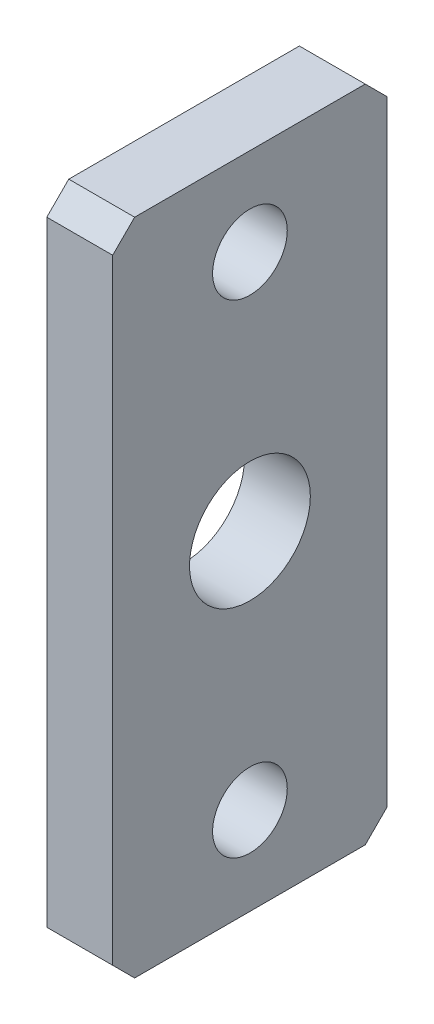
ISO-10303-21;
HEADER;
FILE_DESCRIPTION(('STEP AP214'),'2;1');
FILE_NAME('part.step','',(''),(''),'','','');
FILE_SCHEMA(('AUTOMOTIVE_DESIGN { 1 0 10303 214 1 1 1 1 }'));
ENDSEC;
DATA;
#1=APPLICATION_CONTEXT('core data for automotive mechanical design processes');
#2=APPLICATION_PROTOCOL_DEFINITION('international standard','automotive_design',2000,#1);
#3=PRODUCT_CONTEXT('',#1,'mechanical');
#4=PRODUCT('Part','Part','',(#3));
#5=PRODUCT_RELATED_PRODUCT_CATEGORY('part','',(#4));
#6=PRODUCT_DEFINITION_FORMATION('','',#4);
#7=PRODUCT_DEFINITION_CONTEXT('part definition',#1,'design');
#8=PRODUCT_DEFINITION('design','',#6,#7);
#9=PRODUCT_DEFINITION_SHAPE('','',#8);
#10=(LENGTH_UNIT() NAMED_UNIT(*) SI_UNIT(.MILLI.,.METRE.));
#11=(NAMED_UNIT(*) PLANE_ANGLE_UNIT() SI_UNIT($,.RADIAN.));
#12=(NAMED_UNIT(*) SI_UNIT($,.STERADIAN.) SOLID_ANGLE_UNIT());
#13=UNCERTAINTY_MEASURE_WITH_UNIT(LENGTH_MEASURE(1.E-05),#10,'distance_accuracy_value','');
#14=(GEOMETRIC_REPRESENTATION_CONTEXT(3) GLOBAL_UNCERTAINTY_ASSIGNED_CONTEXT((#13)) GLOBAL_UNIT_ASSIGNED_CONTEXT((#10,
#11,#12)) REPRESENTATION_CONTEXT('',''));
#15=CARTESIAN_POINT('',(0.,0.,0.));
#16=DIRECTION('',(0.,0.,1.));
#17=DIRECTION('',(1.,0.,0.));
#18=AXIS2_PLACEMENT_3D('',#15,#16,#17);
#19=CARTESIAN_POINT('',(-6.00000000000001,30.,0.));
#20=DIRECTION('',(0.,0.,1.));
#21=DIRECTION('',(1.,0.,0.));
#22=AXIS2_PLACEMENT_3D('',#19,#20,#21);
#23=PLANE('',#22);
#24=DIRECTION('',(0.,-1.,0.));
#25=VECTOR('',#24,1.);
#26=CARTESIAN_POINT('',(-6.00000000000001,30.,0.));
#27=LINE('',#26,#25);
#28=CARTESIAN_POINT('',(-6.00000000000001,28.,0.));
#29=VERTEX_POINT('',#28);
#30=CARTESIAN_POINT('',(-6.00000000000001,-28.,0.));
#31=VERTEX_POINT('',#30);
#32=EDGE_CURVE('E157',#29,#31,#27,.T.);
#33=ORIENTED_EDGE('',*,*,#32,.T.);
#34=DIRECTION('',(1.,0.,0.));
#35=VECTOR('',#34,1.);
#36=CARTESIAN_POINT('',(-6.00000000000001,-28.,0.));
#37=LINE('',#36,#35);
#38=CARTESIAN_POINT('',(0.,-28.,0.));
#39=VERTEX_POINT('',#38);
#40=EDGE_CURVE('E11',#31,#39,#37,.T.);
#41=ORIENTED_EDGE('',*,*,#40,.T.);
#42=DIRECTION('',(0.,-1.,0.));
#43=VECTOR('',#42,1.);
#44=CARTESIAN_POINT('',(0.,30.,0.));
#45=LINE('',#44,#43);
#46=CARTESIAN_POINT('',(0.,28.,0.));
#47=VERTEX_POINT('',#46);
#48=EDGE_CURVE('E160',#47,#39,#45,.T.);
#49=ORIENTED_EDGE('',*,*,#48,.F.);
#50=DIRECTION('',(-1.,0.,0.));
#51=VECTOR('',#50,1.);
#52=CARTESIAN_POINT('',(-6.00000000000001,28.,0.));
#53=LINE('',#52,#51);
#54=EDGE_CURVE('E44',#47,#29,#53,.T.);
#55=ORIENTED_EDGE('',*,*,#54,.T.);
#56=EDGE_LOOP('',(#33,#41,#49,#55));
#57=FACE_BOUND('',#56,.T.);
#58=ADVANCED_FACE('F36',(#57),#23,.T.);
#59=CARTESIAN_POINT('',(-6.00000000000001,30.,0.));
#60=DIRECTION('',(0.,1.,0.));
#61=DIRECTION('',(0.,0.,1.));
#62=AXIS2_PLACEMENT_3D('',#59,#60,#61);
#63=PLANE('',#62);
#64=DIRECTION('',(0.,0.,1.));
#65=VECTOR('',#64,1.);
#66=CARTESIAN_POINT('',(0.,30.,0.));
#67=LINE('',#66,#65);
#68=CARTESIAN_POINT('',(0.,30.,-22.9999999999999));
#69=VERTEX_POINT('',#68);
#70=CARTESIAN_POINT('',(0.,30.,-2.));
#71=VERTEX_POINT('',#70);
#72=EDGE_CURVE('E122',#69,#71,#67,.T.);
#73=ORIENTED_EDGE('',*,*,#72,.F.);
#74=DIRECTION('',(-1.,0.,0.));
#75=VECTOR('',#74,1.);
#76=CARTESIAN_POINT('',(-6.00000000000001,30.,-22.9999999999999));
#77=LINE('',#76,#75);
#78=CARTESIAN_POINT('',(-6.00000000000001,30.,-22.9999999999999));
#79=VERTEX_POINT('',#78);
#80=EDGE_CURVE('E140',#69,#79,#77,.T.);
#81=ORIENTED_EDGE('',*,*,#80,.T.);
#82=DIRECTION('',(0.,0.,1.));
#83=VECTOR('',#82,1.);
#84=CARTESIAN_POINT('',(-6.00000000000001,30.,0.));
#85=LINE('',#84,#83);
#86=CARTESIAN_POINT('',(-6.00000000000001,30.,-2.));
#87=VERTEX_POINT('',#86);
#88=EDGE_CURVE('E125',#79,#87,#85,.T.);
#89=ORIENTED_EDGE('',*,*,#88,.T.);
#90=DIRECTION('',(1.,0.,0.));
#91=VECTOR('',#90,1.);
#92=CARTESIAN_POINT('',(-6.00000000000001,30.,-2.));
#93=LINE('',#92,#91);
#94=EDGE_CURVE('E137',#87,#71,#93,.T.);
#95=ORIENTED_EDGE('',*,*,#94,.T.);
#96=EDGE_LOOP('',(#73,#81,#89,#95));
#97=FACE_BOUND('',#96,.T.);
#98=ADVANCED_FACE('F172',(#97),#63,.T.);
#99=CARTESIAN_POINT('',(-6.00000000000001,30.,-24.9999999999999));
#100=DIRECTION('',(0.,0.,-1.));
#101=DIRECTION('',(-1.,0.,0.));
#102=AXIS2_PLACEMENT_3D('',#99,#100,#101);
#103=PLANE('',#102);
#104=DIRECTION('',(0.,1.,0.));
#105=VECTOR('',#104,1.);
#106=CARTESIAN_POINT('',(-6.00000000000001,30.,-24.9999999999999));
#107=LINE('',#106,#105);
#108=CARTESIAN_POINT('',(-6.00000000000001,-28.,-24.9999999999999));
#109=VERTEX_POINT('',#108);
#110=CARTESIAN_POINT('',(-6.00000000000001,28.,-24.9999999999999));
#111=VERTEX_POINT('',#110);
#112=EDGE_CURVE('E130',#109,#111,#107,.T.);
#113=ORIENTED_EDGE('',*,*,#112,.T.);
#114=DIRECTION('',(1.,0.,0.));
#115=VECTOR('',#114,1.);
#116=CARTESIAN_POINT('',(-6.00000000000001,28.,-24.9999999999999));
#117=LINE('',#116,#115);
#118=CARTESIAN_POINT('',(0.,28.,-24.9999999999999));
#119=VERTEX_POINT('',#118);
#120=EDGE_CURVE('E121',#111,#119,#117,.T.);
#121=ORIENTED_EDGE('',*,*,#120,.T.);
#122=DIRECTION('',(0.,1.,0.));
#123=VECTOR('',#122,1.);
#124=CARTESIAN_POINT('',(0.,30.,-24.9999999999999));
#125=LINE('',#124,#123);
#126=CARTESIAN_POINT('',(0.,-28.,-24.9999999999999));
#127=VERTEX_POINT('',#126);
#128=EDGE_CURVE('E106',#127,#119,#125,.T.);
#129=ORIENTED_EDGE('',*,*,#128,.F.);
#130=DIRECTION('',(-1.,0.,0.));
#131=VECTOR('',#130,1.);
#132=CARTESIAN_POINT('',(-6.00000000000001,-28.,-24.9999999999999));
#133=LINE('',#132,#131);
#134=EDGE_CURVE('E119',#127,#109,#133,.T.);
#135=ORIENTED_EDGE('',*,*,#134,.T.);
#136=EDGE_LOOP('',(#113,#121,#129,#135));
#137=FACE_BOUND('',#136,.T.);
#138=ADVANCED_FACE('F118',(#137),#103,.T.);
#139=CARTESIAN_POINT('',(-6.00000000000001,-30.,0.));
#140=DIRECTION('',(0.,-1.,0.));
#141=DIRECTION('',(0.,0.,-1.));
#142=AXIS2_PLACEMENT_3D('',#139,#140,#141);
#143=PLANE('',#142);
#144=DIRECTION('',(0.,0.,-1.));
#145=VECTOR('',#144,1.);
#146=CARTESIAN_POINT('',(-6.00000000000001,-30.,0.));
#147=LINE('',#146,#145);
#148=CARTESIAN_POINT('',(-6.00000000000001,-30.,-2.));
#149=VERTEX_POINT('',#148);
#150=CARTESIAN_POINT('',(-6.00000000000001,-30.,-22.9999999999999));
#151=VERTEX_POINT('',#150);
#152=EDGE_CURVE('E166',#149,#151,#147,.T.);
#153=ORIENTED_EDGE('',*,*,#152,.T.);
#154=DIRECTION('',(1.,0.,0.));
#155=VECTOR('',#154,1.);
#156=CARTESIAN_POINT('',(-6.00000000000001,-30.,-22.9999999999999));
#157=LINE('',#156,#155);
#158=CARTESIAN_POINT('',(0.,-30.,-22.9999999999999));
#159=VERTEX_POINT('',#158);
#160=EDGE_CURVE('E151',#151,#159,#157,.T.);
#161=ORIENTED_EDGE('',*,*,#160,.T.);
#162=DIRECTION('',(0.,0.,-1.));
#163=VECTOR('',#162,1.);
#164=CARTESIAN_POINT('',(0.,-30.,0.));
#165=LINE('',#164,#163);
#166=CARTESIAN_POINT('',(0.,-30.,-2.));
#167=VERTEX_POINT('',#166);
#168=EDGE_CURVE('E107',#167,#159,#165,.T.);
#169=ORIENTED_EDGE('',*,*,#168,.F.);
#170=DIRECTION('',(-1.,0.,0.));
#171=VECTOR('',#170,1.);
#172=CARTESIAN_POINT('',(-6.00000000000001,-30.,-2.));
#173=LINE('',#172,#171);
#174=EDGE_CURVE('E58',#167,#149,#173,.T.);
#175=ORIENTED_EDGE('',*,*,#174,.T.);
#176=EDGE_LOOP('',(#153,#161,#169,#175));
#177=FACE_BOUND('',#176,.T.);
#178=ADVANCED_FACE('F235',(#177),#143,.T.);
#179=CARTESIAN_POINT('',(-6.00000000000001,-30.,0.));
#180=DIRECTION('',(1.,0.,0.));
#181=DIRECTION('',(0.,0.,-1.));
#182=AXIS2_PLACEMENT_3D('',#179,#180,#181);
#183=PLANE('',#182);
#184=CARTESIAN_POINT('',(-6.00000000000001,22.,-12.5));
#185=DIRECTION('',(1.,0.,0.));
#186=DIRECTION('',(0.,0.,-1.));
#187=AXIS2_PLACEMENT_3D('',#184,#185,#186);
#188=CIRCLE('',#187,3.4);
#189=CARTESIAN_POINT('',(-6.00000000000001,22.,-15.9));
#190=VERTEX_POINT('',#189);
#191=EDGE_CURVE('E200',#190,#190,#188,.T.);
#192=ORIENTED_EDGE('',*,*,#191,.T.);
#193=EDGE_LOOP('',(#192));
#194=FACE_BOUND('',#193,.T.);
#195=CARTESIAN_POINT('',(-6.00000000000001,-22.,-12.5));
#196=DIRECTION('',(1.,0.,0.));
#197=DIRECTION('',(0.,0.,-1.));
#198=AXIS2_PLACEMENT_3D('',#195,#196,#197);
#199=CIRCLE('',#198,3.4);
#200=CARTESIAN_POINT('',(-6.00000000000001,-22.,-15.9));
#201=VERTEX_POINT('',#200);
#202=EDGE_CURVE('E192',#201,#201,#199,.T.);
#203=ORIENTED_EDGE('',*,*,#202,.T.);
#204=EDGE_LOOP('',(#203));
#205=FACE_BOUND('',#204,.T.);
#206=CARTESIAN_POINT('',(-6.00000000000001,0.,-12.5));
#207=DIRECTION('',(1.,0.,0.));
#208=DIRECTION('',(0.,0.,-1.));
#209=AXIS2_PLACEMENT_3D('',#206,#207,#208);
#210=CIRCLE('',#209,5.5);
#211=CARTESIAN_POINT('',(-6.00000000000001,0.,-18.));
#212=VERTEX_POINT('',#211);
#213=EDGE_CURVE('E182',#212,#212,#210,.T.);
#214=ORIENTED_EDGE('',*,*,#213,.T.);
#215=EDGE_LOOP('',(#214));
#216=FACE_BOUND('',#215,.T.);
#217=ORIENTED_EDGE('',*,*,#88,.F.);
#218=DIRECTION('',(0.,0.707106781186546,0.707106781186549));
#219=VECTOR('',#218,1.);
#220=CARTESIAN_POINT('',(-6.00000000000001,28.,-24.9999999999999));
#221=LINE('',#220,#219);
#222=EDGE_CURVE('E147',#79,#111,#221,.F.);
#223=ORIENTED_EDGE('',*,*,#222,.T.);
#224=ORIENTED_EDGE('',*,*,#112,.F.);
#225=DIRECTION('',(0.,0.707106781186549,-0.707106781186546));
#226=VECTOR('',#225,1.);
#227=CARTESIAN_POINT('',(-6.00000000000001,-30.,-22.9999999999999));
#228=LINE('',#227,#226);
#229=EDGE_CURVE('E51',#109,#151,#228,.F.);
#230=ORIENTED_EDGE('',*,*,#229,.T.);
#231=ORIENTED_EDGE('',*,*,#152,.F.);
#232=DIRECTION('',(0.,-0.707106781186546,-0.707106781186549));
#233=VECTOR('',#232,1.);
#234=CARTESIAN_POINT('',(-6.00000000000001,-28.,0.));
#235=LINE('',#234,#233);
#236=EDGE_CURVE('E144',#149,#31,#235,.F.);
#237=ORIENTED_EDGE('',*,*,#236,.T.);
#238=ORIENTED_EDGE('',*,*,#32,.F.);
#239=DIRECTION('',(0.,-0.707106781186549,0.707106781186546));
#240=VECTOR('',#239,1.);
#241=CARTESIAN_POINT('',(-6.00000000000001,30.,-2.));
#242=LINE('',#241,#240);
#243=EDGE_CURVE('E142',#29,#87,#242,.F.);
#244=ORIENTED_EDGE('',*,*,#243,.T.);
#245=EDGE_LOOP('',(#217,#223,#224,#230,#231,#237,#238,#244));
#246=FACE_BOUND('',#245,.T.);
#247=ADVANCED_FACE('F164',(#194,#205,#216,#246),#183,.F.);
#248=CARTESIAN_POINT('',(0.,-30.,0.));
#249=DIRECTION('',(1.,0.,0.));
#250=DIRECTION('',(0.,0.,-1.));
#251=AXIS2_PLACEMENT_3D('',#248,#249,#250);
#252=PLANE('',#251);
#253=CARTESIAN_POINT('',(0.,22.,-12.5));
#254=DIRECTION('',(1.,0.,0.));
#255=DIRECTION('',(0.,0.,-1.));
#256=AXIS2_PLACEMENT_3D('',#253,#254,#255);
#257=CIRCLE('',#256,3.39999999999999);
#258=CARTESIAN_POINT('',(0.,22.,-15.8999999999999));
#259=VERTEX_POINT('',#258);
#260=EDGE_CURVE('E203',#259,#259,#257,.T.);
#261=ORIENTED_EDGE('',*,*,#260,.F.);
#262=EDGE_LOOP('',(#261));
#263=FACE_BOUND('',#262,.T.);
#264=CARTESIAN_POINT('',(0.,-22.,-12.5));
#265=DIRECTION('',(1.,0.,0.));
#266=DIRECTION('',(0.,0.,-1.));
#267=AXIS2_PLACEMENT_3D('',#264,#265,#266);
#268=CIRCLE('',#267,3.39999999999999);
#269=CARTESIAN_POINT('',(0.,-22.,-15.8999999999999));
#270=VERTEX_POINT('',#269);
#271=EDGE_CURVE('E197',#270,#270,#268,.T.);
#272=ORIENTED_EDGE('',*,*,#271,.F.);
#273=EDGE_LOOP('',(#272));
#274=FACE_BOUND('',#273,.T.);
#275=CARTESIAN_POINT('',(0.,0.,-12.5));
#276=DIRECTION('',(1.,0.,0.));
#277=DIRECTION('',(0.,0.,-1.));
#278=AXIS2_PLACEMENT_3D('',#275,#276,#277);
#279=CIRCLE('',#278,5.49999999999999);
#280=CARTESIAN_POINT('',(0.,0.,-17.9999999999999));
#281=VERTEX_POINT('',#280);
#282=EDGE_CURVE('E185',#281,#281,#279,.T.);
#283=ORIENTED_EDGE('',*,*,#282,.F.);
#284=EDGE_LOOP('',(#283));
#285=FACE_BOUND('',#284,.T.);
#286=ORIENTED_EDGE('',*,*,#128,.T.);
#287=DIRECTION('',(0.,-0.707106781186546,-0.707106781186549));
#288=VECTOR('',#287,1.);
#289=CARTESIAN_POINT('',(0.,11.5000000000001,-41.4999999999999));
#290=LINE('',#289,#288);
#291=EDGE_CURVE('E112',#119,#69,#290,.F.);
#292=ORIENTED_EDGE('',*,*,#291,.T.);
#293=ORIENTED_EDGE('',*,*,#72,.T.);
#294=DIRECTION('',(0.,0.707106781186549,-0.707106781186546));
#295=VECTOR('',#294,1.);
#296=CARTESIAN_POINT('',(0.,-1.00000000000011,28.9999999999999));
#297=LINE('',#296,#295);
#298=EDGE_CURVE('E127',#71,#47,#297,.F.);
#299=ORIENTED_EDGE('',*,*,#298,.T.);
#300=ORIENTED_EDGE('',*,*,#48,.T.);
#301=DIRECTION('',(0.,0.707106781186546,0.707106781186549));
#302=VECTOR('',#301,1.);
#303=CARTESIAN_POINT('',(0.,-29.,-1.00000000000011));
#304=LINE('',#303,#302);
#305=EDGE_CURVE('E113',#39,#167,#304,.F.);
#306=ORIENTED_EDGE('',*,*,#305,.T.);
#307=ORIENTED_EDGE('',*,*,#168,.T.);
#308=DIRECTION('',(0.,-0.707106781186549,0.707106781186546));
#309=VECTOR('',#308,1.);
#310=CARTESIAN_POINT('',(0.,-41.5,-11.5000000000001));
#311=LINE('',#310,#309);
#312=EDGE_CURVE('E103',#159,#127,#311,.F.);
#313=ORIENTED_EDGE('',*,*,#312,.T.);
#314=EDGE_LOOP('',(#286,#292,#293,#299,#300,#306,#307,#313));
#315=FACE_BOUND('',#314,.T.);
#316=ADVANCED_FACE('F105',(#263,#274,#285,#315),#252,.T.);
#317=CARTESIAN_POINT('',(0.,0.,-12.5));
#318=DIRECTION('',(1.,0.,0.));
#319=DIRECTION('',(0.,0.,-1.));
#320=AXIS2_PLACEMENT_3D('',#317,#318,#319);
#321=CYLINDRICAL_SURFACE('',#320,5.49999999999999);
#322=ORIENTED_EDGE('',*,*,#213,.F.);
#323=EDGE_LOOP('',(#322));
#324=FACE_BOUND('',#323,.T.);
#325=ORIENTED_EDGE('',*,*,#282,.T.);
#326=EDGE_LOOP('',(#325));
#327=FACE_BOUND('',#326,.T.);
#328=ADVANCED_FACE('F211',(#324,#327),#321,.F.);
#329=CARTESIAN_POINT('',(0.,-22.,-12.5));
#330=DIRECTION('',(1.,0.,0.));
#331=DIRECTION('',(0.,0.,-1.));
#332=AXIS2_PLACEMENT_3D('',#329,#330,#331);
#333=CYLINDRICAL_SURFACE('',#332,3.39999999999999);
#334=ORIENTED_EDGE('',*,*,#202,.F.);
#335=EDGE_LOOP('',(#334));
#336=FACE_BOUND('',#335,.T.);
#337=ORIENTED_EDGE('',*,*,#271,.T.);
#338=EDGE_LOOP('',(#337));
#339=FACE_BOUND('',#338,.T.);
#340=ADVANCED_FACE('F218',(#336,#339),#333,.F.);
#341=CARTESIAN_POINT('',(0.,22.,-12.5));
#342=DIRECTION('',(1.,0.,0.));
#343=DIRECTION('',(0.,0.,-1.));
#344=AXIS2_PLACEMENT_3D('',#341,#342,#343);
#345=CYLINDRICAL_SURFACE('',#344,3.39999999999999);
#346=ORIENTED_EDGE('',*,*,#191,.F.);
#347=EDGE_LOOP('',(#346));
#348=FACE_BOUND('',#347,.T.);
#349=ORIENTED_EDGE('',*,*,#260,.T.);
#350=EDGE_LOOP('',(#349));
#351=FACE_BOUND('',#350,.T.);
#352=ADVANCED_FACE('F207',(#348,#351),#345,.F.);
#353=CARTESIAN_POINT('',(-6.00000000000001,28.,-24.9999999999999));
#354=DIRECTION('',(0.,-0.707106781186549,0.707106781186546));
#355=DIRECTION('',(0.,-0.707106781186546,-0.707106781186549));
#356=AXIS2_PLACEMENT_3D('',#353,#354,#355);
#357=PLANE('',#356);
#358=ORIENTED_EDGE('',*,*,#222,.F.);
#359=ORIENTED_EDGE('',*,*,#80,.F.);
#360=ORIENTED_EDGE('',*,*,#291,.F.);
#361=ORIENTED_EDGE('',*,*,#120,.F.);
#362=EDGE_LOOP('',(#358,#359,#360,#361));
#363=FACE_BOUND('',#362,.T.);
#364=ADVANCED_FACE('F176',(#363),#357,.F.);
#365=CARTESIAN_POINT('',(-6.00000000000001,-30.,-22.9999999999999));
#366=DIRECTION('',(0.,0.707106781186546,0.707106781186549));
#367=DIRECTION('',(0.,-0.707106781186549,0.707106781186546));
#368=AXIS2_PLACEMENT_3D('',#365,#366,#367);
#369=PLANE('',#368);
#370=ORIENTED_EDGE('',*,*,#229,.F.);
#371=ORIENTED_EDGE('',*,*,#134,.F.);
#372=ORIENTED_EDGE('',*,*,#312,.F.);
#373=ORIENTED_EDGE('',*,*,#160,.F.);
#374=EDGE_LOOP('',(#370,#371,#372,#373));
#375=FACE_BOUND('',#374,.T.);
#376=ADVANCED_FACE('F124',(#375),#369,.F.);
#377=CARTESIAN_POINT('',(-6.00000000000001,-28.,0.));
#378=DIRECTION('',(0.,0.707106781186549,-0.707106781186546));
#379=DIRECTION('',(0.,0.707106781186546,0.707106781186549));
#380=AXIS2_PLACEMENT_3D('',#377,#378,#379);
#381=PLANE('',#380);
#382=ORIENTED_EDGE('',*,*,#236,.F.);
#383=ORIENTED_EDGE('',*,*,#174,.F.);
#384=ORIENTED_EDGE('',*,*,#305,.F.);
#385=ORIENTED_EDGE('',*,*,#40,.F.);
#386=EDGE_LOOP('',(#382,#383,#384,#385));
#387=FACE_BOUND('',#386,.T.);
#388=ADVANCED_FACE('F240',(#387),#381,.F.);
#389=CARTESIAN_POINT('',(-6.00000000000001,30.,-2.));
#390=DIRECTION('',(0.,-0.707106781186546,-0.707106781186549));
#391=DIRECTION('',(0.,0.707106781186549,-0.707106781186546));
#392=AXIS2_PLACEMENT_3D('',#389,#390,#391);
#393=PLANE('',#392);
#394=ORIENTED_EDGE('',*,*,#243,.F.);
#395=ORIENTED_EDGE('',*,*,#54,.F.);
#396=ORIENTED_EDGE('',*,*,#298,.F.);
#397=ORIENTED_EDGE('',*,*,#94,.F.);
#398=EDGE_LOOP('',(#394,#395,#396,#397));
#399=FACE_BOUND('',#398,.T.);
#400=ADVANCED_FACE('F38',(#399),#393,.F.);
#401=CLOSED_SHELL('',(#58,#98,#138,#178,#247,#316,#328,#340,#352,#364,#376,#388,#400));
#402=MANIFOLD_SOLID_BREP('B2',#401);
#403=ADVANCED_BREP_SHAPE_REPRESENTATION('',(#18,#402),#14);
#404=SHAPE_DEFINITION_REPRESENTATION(#9,#403);
ENDSEC;
END-ISO-10303-21;
